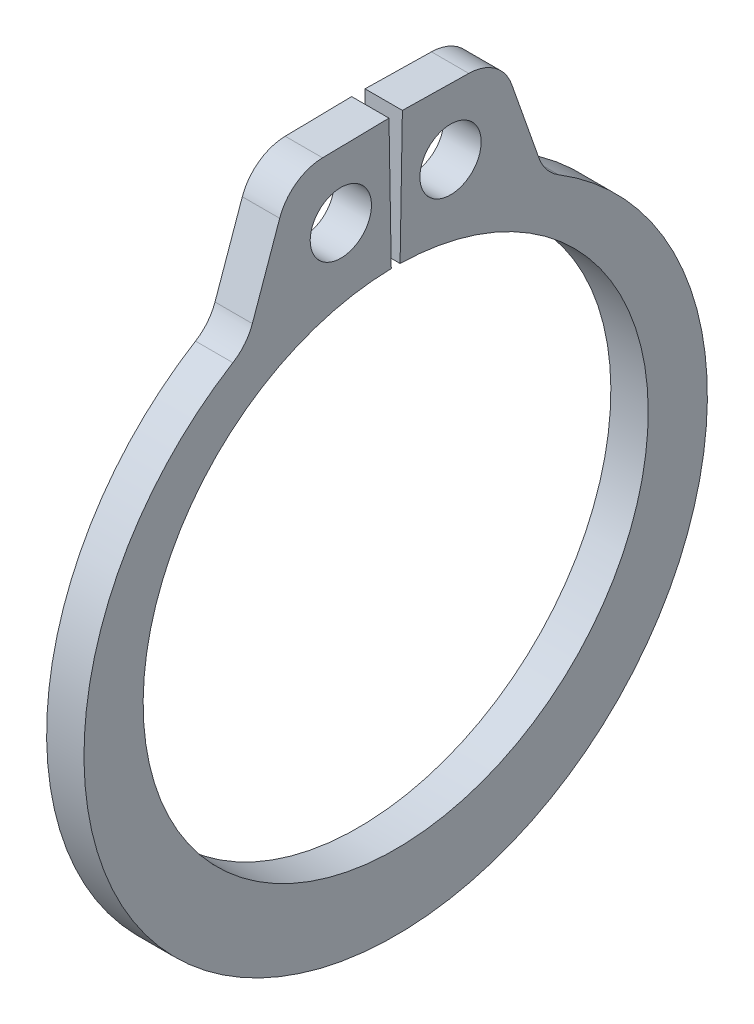
ISO-10303-21;
HEADER;
FILE_DESCRIPTION(('STEP AP214'),'2;1');
FILE_NAME('part.step','',(''),(''),'','','');
FILE_SCHEMA(('AUTOMOTIVE_DESIGN { 1 0 10303 214 1 1 1 1 }'));
ENDSEC;
DATA;
#1=APPLICATION_CONTEXT('core data for automotive mechanical design processes');
#2=APPLICATION_PROTOCOL_DEFINITION('international standard','automotive_design',2000,#1);
#3=PRODUCT_CONTEXT('',#1,'mechanical');
#4=PRODUCT('Part','Part','',(#3));
#5=PRODUCT_RELATED_PRODUCT_CATEGORY('part','',(#4));
#6=PRODUCT_DEFINITION_FORMATION('','',#4);
#7=PRODUCT_DEFINITION_CONTEXT('part definition',#1,'design');
#8=PRODUCT_DEFINITION('design','',#6,#7);
#9=PRODUCT_DEFINITION_SHAPE('','',#8);
#10=(LENGTH_UNIT() NAMED_UNIT(*) SI_UNIT(.MILLI.,.METRE.));
#11=(NAMED_UNIT(*) PLANE_ANGLE_UNIT() SI_UNIT($,.RADIAN.));
#12=(NAMED_UNIT(*) SI_UNIT($,.STERADIAN.) SOLID_ANGLE_UNIT());
#13=UNCERTAINTY_MEASURE_WITH_UNIT(LENGTH_MEASURE(1.E-05),#10,'distance_accuracy_value','');
#14=(GEOMETRIC_REPRESENTATION_CONTEXT(3) GLOBAL_UNCERTAINTY_ASSIGNED_CONTEXT((#13)) GLOBAL_UNIT_ASSIGNED_CONTEXT((#10,
#11,#12)) REPRESENTATION_CONTEXT('',''));
#15=CARTESIAN_POINT('',(0.,0.,0.));
#16=DIRECTION('',(0.,0.,1.));
#17=DIRECTION('',(1.,0.,0.));
#18=AXIS2_PLACEMENT_3D('',#15,#16,#17);
#19=CARTESIAN_POINT('',(0.3175,0.,0.));
#20=DIRECTION('',(1.,0.,0.));
#21=DIRECTION('',(0.,0.,-1.));
#22=AXIS2_PLACEMENT_3D('',#19,#20,#21);
#23=PLANE('',#22);
#24=CARTESIAN_POINT('',(0.3175,5.39474739325938,-0.932493347387071));
#25=DIRECTION('',(-1.,0.,0.));
#26=DIRECTION('',(0.,0.,1.));
#27=AXIS2_PLACEMENT_3D('',#24,#25,#26);
#28=CIRCLE('',#27,0.5207);
#29=CARTESIAN_POINT('',(0.3175,5.39474739325938,-0.411793347387071));
#30=VERTEX_POINT('',#29);
#31=EDGE_CURVE('E171',#30,#30,#28,.T.);
#32=ORIENTED_EDGE('',*,*,#31,.T.);
#33=EDGE_LOOP('',(#32));
#34=FACE_BOUND('',#33,.T.);
#35=CARTESIAN_POINT('',(0.3175,5.39474739325938,0.932493347387071));
#36=DIRECTION('',(-1.,0.,0.));
#37=DIRECTION('',(0.,0.,1.));
#38=AXIS2_PLACEMENT_3D('',#35,#36,#37);
#39=CIRCLE('',#38,0.5207);
#40=CARTESIAN_POINT('',(0.3175,5.39474739325938,1.45319334738707));
#41=VERTEX_POINT('',#40);
#42=EDGE_CURVE('E109',#41,#41,#39,.T.);
#43=ORIENTED_EDGE('',*,*,#42,.T.);
#44=EDGE_LOOP('',(#43));
#45=FACE_BOUND('',#44,.T.);
#46=CARTESIAN_POINT('',(0.3175,0.,0.));
#47=DIRECTION('',(-1.,0.,0.));
#48=DIRECTION('',(0.,0.,1.));
#49=AXIS2_PLACEMENT_3D('',#46,#47,#48);
#50=CIRCLE('',#49,4.2926);
#51=CARTESIAN_POINT('',(0.3175,4.29194621622833,-0.0749161998726857));
#52=VERTEX_POINT('',#51);
#53=CARTESIAN_POINT('',(0.3175,4.29194621622832,0.0749161998726854));
#54=VERTEX_POINT('',#53);
#55=EDGE_CURVE('E177',#52,#54,#50,.T.);
#56=ORIENTED_EDGE('',*,*,#55,.T.);
#57=DIRECTION('',(0.,-0.999847695156391,-0.017452406437283));
#58=VECTOR('',#57,1.);
#59=CARTESIAN_POINT('',(0.3175,4.29194621622832,0.0749161998726854));
#60=LINE('',#59,#58);
#61=CARTESIAN_POINT('',(0.3175,6.5268057844419,0.113925818741302));
#62=VERTEX_POINT('',#61);
#63=EDGE_CURVE('E124',#54,#62,#60,.F.);
#64=ORIENTED_EDGE('',*,*,#63,.T.);
#65=DIRECTION('',(0.,0.017452406437294,-0.999847695156391));
#66=VECTOR('',#65,1.);
#67=CARTESIAN_POINT('',(0.3175,6.5268057844419,0.113925818741303));
#68=LINE('',#67,#66);
#69=CARTESIAN_POINT('',(0.3175,6.50710052961542,1.2428391116738));
#70=VERTEX_POINT('',#69);
#71=EDGE_CURVE('E119',#62,#70,#68,.F.);
#72=ORIENTED_EDGE('',*,*,#71,.T.);
#73=CARTESIAN_POINT('',(0.3175,5.71982045444927,1.22909708684508));
#74=DIRECTION('',(-1.,0.,0.));
#75=DIRECTION('',(0.,0.,1.));
#76=AXIS2_PLACEMENT_3D('',#73,#74,#75);
#77=CIRCLE('',#76,0.7874);
#78=CARTESIAN_POINT('',(0.3175,5.98129100900125,1.9718163535282));
#79=VERTEX_POINT('',#78);
#80=EDGE_CURVE('E112',#79,#70,#77,.T.);
#81=ORIENTED_EDGE('',*,*,#80,.F.);
#82=DIRECTION('',(0.,0.94325535519825,-0.332068268417539));
#83=VECTOR('',#82,1.);
#84=CARTESIAN_POINT('',(0.3175,6.49754857029043,1.79007049490148));
#85=LINE('',#84,#83);
#86=CARTESIAN_POINT('',(0.3175,4.66344515220106,2.43575731002231));
#87=VERTEX_POINT('',#86);
#88=EDGE_CURVE('E107',#79,#87,#85,.F.);
#89=ORIENTED_EDGE('',*,*,#88,.T.);
#90=CARTESIAN_POINT('',(0.3175,4.92491570675303,3.17847657670541));
#91=DIRECTION('',(-1.,0.,0.));
#92=DIRECTION('',(0.,0.,1.));
#93=AXIS2_PLACEMENT_3D('',#90,#91,#92);
#94=CIRCLE('',#93,0.7874);
#95=CARTESIAN_POINT('',(0.3175,4.25345366496523,2.76721329553604));
#96=VERTEX_POINT('',#95);
#97=EDGE_CURVE('E20',#87,#96,#94,.T.);
#98=ORIENTED_EDGE('',*,*,#97,.T.);
#99=CARTESIAN_POINT('',(0.3175,-0.264524901465116,0.));
#100=DIRECTION('',(-1.,0.,0.));
#101=DIRECTION('',(0.,0.,1.));
#102=AXIS2_PLACEMENT_3D('',#99,#100,#101);
#103=CIRCLE('',#102,5.29807509853489);
#104=CARTESIAN_POINT('',(0.3175,4.25345366496524,-2.76721329553605));
#105=VERTEX_POINT('',#104);
#106=EDGE_CURVE('E105',#105,#96,#103,.T.);
#107=ORIENTED_EDGE('',*,*,#106,.F.);
#108=CARTESIAN_POINT('',(0.3175,4.92491570675303,-3.17847657670541));
#109=DIRECTION('',(-1.,0.,0.));
#110=DIRECTION('',(0.,0.,1.));
#111=AXIS2_PLACEMENT_3D('',#108,#109,#110);
#112=CIRCLE('',#111,0.7874);
#113=CARTESIAN_POINT('',(0.3175,4.66344515220106,-2.43575731002231));
#114=VERTEX_POINT('',#113);
#115=EDGE_CURVE('E181',#105,#114,#112,.T.);
#116=ORIENTED_EDGE('',*,*,#115,.T.);
#117=DIRECTION('',(0.,-0.94325535519825,-0.332068268417539));
#118=VECTOR('',#117,1.);
#119=CARTESIAN_POINT('',(0.3175,6.49754857029043,-1.79007049490148));
#120=LINE('',#119,#118);
#121=CARTESIAN_POINT('',(0.3175,5.98129100900124,-1.97181635352819));
#122=VERTEX_POINT('',#121);
#123=EDGE_CURVE('E142',#114,#122,#120,.F.);
#124=ORIENTED_EDGE('',*,*,#123,.T.);
#125=CARTESIAN_POINT('',(0.3175,5.71982045444927,-1.22909708684508));
#126=DIRECTION('',(-1.,0.,0.));
#127=DIRECTION('',(0.,0.,1.));
#128=AXIS2_PLACEMENT_3D('',#125,#126,#127);
#129=CIRCLE('',#128,0.7874);
#130=CARTESIAN_POINT('',(0.3175,6.50710052961543,-1.2428391116738));
#131=VERTEX_POINT('',#130);
#132=EDGE_CURVE('E144',#131,#122,#129,.T.);
#133=ORIENTED_EDGE('',*,*,#132,.F.);
#134=DIRECTION('',(0.,-0.017452406437294,-0.999847695156391));
#135=VECTOR('',#134,1.);
#136=CARTESIAN_POINT('',(0.3175,6.5268057844419,-0.113925818741303));
#137=LINE('',#136,#135);
#138=CARTESIAN_POINT('',(0.3175,6.5268057844419,-0.113925818741301));
#139=VERTEX_POINT('',#138);
#140=EDGE_CURVE('E136',#131,#139,#137,.F.);
#141=ORIENTED_EDGE('',*,*,#140,.T.);
#142=DIRECTION('',(0.,0.999847695156391,-0.017452406437283));
#143=VECTOR('',#142,1.);
#144=CARTESIAN_POINT('',(0.3175,4.29194621622832,-0.0749161998726854));
#145=LINE('',#144,#143);
#146=EDGE_CURVE('E130',#139,#52,#145,.F.);
#147=ORIENTED_EDGE('',*,*,#146,.T.);
#148=EDGE_LOOP('',(#56,#64,#72,#81,#89,#98,#107,#116,#124,#133,#141,#147));
#149=FACE_BOUND('',#148,.T.);
#150=ADVANCED_FACE('F17',(#34,#45,#149),#23,.T.);
#151=CARTESIAN_POINT('',(0.3175,4.92491570675303,3.17847657670541));
#152=DIRECTION('',(-1.,0.,0.));
#153=DIRECTION('',(0.,0.,1.));
#154=AXIS2_PLACEMENT_3D('',#151,#152,#153);
#155=CYLINDRICAL_SURFACE('',#154,0.7874);
#156=DIRECTION('',(1.,0.,0.));
#157=VECTOR('',#156,1.);
#158=CARTESIAN_POINT('',(0.3175,4.66344515220106,2.43575731002232));
#159=LINE('',#158,#157);
#160=CARTESIAN_POINT('',(-0.3175,4.66344515220106,2.4357573100223));
#161=VERTEX_POINT('',#160);
#162=EDGE_CURVE('E101',#87,#161,#159,.F.);
#163=ORIENTED_EDGE('',*,*,#162,.T.);
#164=CARTESIAN_POINT('',(-0.3175,4.92491570675303,3.17847657670541));
#165=DIRECTION('',(-1.,0.,0.));
#166=DIRECTION('',(0.,0.,1.));
#167=AXIS2_PLACEMENT_3D('',#164,#165,#166);
#168=CIRCLE('',#167,0.7874);
#169=CARTESIAN_POINT('',(-0.3175,4.25345366496523,2.76721329553604));
#170=VERTEX_POINT('',#169);
#171=EDGE_CURVE('E169',#161,#170,#168,.T.);
#172=ORIENTED_EDGE('',*,*,#171,.T.);
#173=DIRECTION('',(-1.,0.,0.));
#174=VECTOR('',#173,1.);
#175=CARTESIAN_POINT('',(0.3175,4.25345366496523,2.76721329553604));
#176=LINE('',#175,#174);
#177=EDGE_CURVE('E102',#96,#170,#176,.T.);
#178=ORIENTED_EDGE('',*,*,#177,.F.);
#179=ORIENTED_EDGE('',*,*,#97,.F.);
#180=EDGE_LOOP('',(#163,#172,#178,#179));
#181=FACE_BOUND('',#180,.T.);
#182=ADVANCED_FACE('F99',(#181),#155,.F.);
#183=CARTESIAN_POINT('',(0.3175,-0.264524901465116,0.));
#184=DIRECTION('',(-1.,0.,0.));
#185=DIRECTION('',(0.,0.,1.));
#186=AXIS2_PLACEMENT_3D('',#183,#184,#185);
#187=CYLINDRICAL_SURFACE('',#186,5.29807509853489);
#188=CARTESIAN_POINT('',(-0.3175,-0.264524901465116,0.));
#189=DIRECTION('',(-1.,0.,0.));
#190=DIRECTION('',(0.,0.,1.));
#191=AXIS2_PLACEMENT_3D('',#188,#189,#190);
#192=CIRCLE('',#191,5.29807509853489);
#193=CARTESIAN_POINT('',(-0.3175,4.25345366496524,-2.76721329553605));
#194=VERTEX_POINT('',#193);
#195=EDGE_CURVE('E166',#170,#194,#192,.F.);
#196=ORIENTED_EDGE('',*,*,#195,.T.);
#197=DIRECTION('',(-1.,0.,0.));
#198=VECTOR('',#197,1.);
#199=CARTESIAN_POINT('',(0.3175,4.25345366496524,-2.76721329553605));
#200=LINE('',#199,#198);
#201=EDGE_CURVE('E182',#194,#105,#200,.F.);
#202=ORIENTED_EDGE('',*,*,#201,.T.);
#203=ORIENTED_EDGE('',*,*,#106,.T.);
#204=ORIENTED_EDGE('',*,*,#177,.T.);
#205=EDGE_LOOP('',(#196,#202,#203,#204));
#206=FACE_BOUND('',#205,.T.);
#207=ADVANCED_FACE('F265',(#206),#187,.T.);
#208=CARTESIAN_POINT('',(0.3175,4.92491570675303,-3.17847657670541));
#209=DIRECTION('',(-1.,0.,0.));
#210=DIRECTION('',(0.,0.,1.));
#211=AXIS2_PLACEMENT_3D('',#208,#209,#210);
#212=CYLINDRICAL_SURFACE('',#211,0.7874);
#213=ORIENTED_EDGE('',*,*,#201,.F.);
#214=CARTESIAN_POINT('',(-0.3175,4.92491570675303,-3.17847657670541));
#215=DIRECTION('',(-1.,0.,0.));
#216=DIRECTION('',(0.,0.,1.));
#217=AXIS2_PLACEMENT_3D('',#214,#215,#216);
#218=CIRCLE('',#217,0.7874);
#219=CARTESIAN_POINT('',(-0.3175,4.66344515220106,-2.4357573100223));
#220=VERTEX_POINT('',#219);
#221=EDGE_CURVE('E163',#194,#220,#218,.T.);
#222=ORIENTED_EDGE('',*,*,#221,.T.);
#223=DIRECTION('',(1.,0.,0.));
#224=VECTOR('',#223,1.);
#225=CARTESIAN_POINT('',(0.3175,4.66344515220106,-2.43575731002232));
#226=LINE('',#225,#224);
#227=EDGE_CURVE('E145',#220,#114,#226,.T.);
#228=ORIENTED_EDGE('',*,*,#227,.T.);
#229=ORIENTED_EDGE('',*,*,#115,.F.);
#230=EDGE_LOOP('',(#213,#222,#228,#229));
#231=FACE_BOUND('',#230,.T.);
#232=ADVANCED_FACE('F264',(#231),#212,.F.);
#233=CARTESIAN_POINT('',(0.3175,6.49754857029043,-1.79007049490148));
#234=DIRECTION('',(0.,-0.332068268417539,0.94325535519825));
#235=DIRECTION('',(0.,-0.94325535519825,-0.332068268417539));
#236=AXIS2_PLACEMENT_3D('',#233,#234,#235);
#237=PLANE('',#236);
#238=ORIENTED_EDGE('',*,*,#227,.F.);
#239=DIRECTION('',(0.,0.943255355198251,0.332068268417537));
#240=VECTOR('',#239,1.);
#241=CARTESIAN_POINT('',(-0.3175,4.66344515220105,-2.4357573100223));
#242=LINE('',#241,#240);
#243=CARTESIAN_POINT('',(-0.3175,5.98129100900124,-1.97181635352819));
#244=VERTEX_POINT('',#243);
#245=EDGE_CURVE('E162',#220,#244,#242,.T.);
#246=ORIENTED_EDGE('',*,*,#245,.T.);
#247=DIRECTION('',(-1.,0.,0.));
#248=VECTOR('',#247,1.);
#249=CARTESIAN_POINT('',(0.3175,5.98129100900124,-1.97181635352818));
#250=LINE('',#249,#248);
#251=EDGE_CURVE('E180',#122,#244,#250,.T.);
#252=ORIENTED_EDGE('',*,*,#251,.F.);
#253=ORIENTED_EDGE('',*,*,#123,.F.);
#254=EDGE_LOOP('',(#238,#246,#252,#253));
#255=FACE_BOUND('',#254,.T.);
#256=ADVANCED_FACE('F261',(#255),#237,.F.);
#257=CARTESIAN_POINT('',(0.3175,5.71982045444927,-1.22909708684508));
#258=DIRECTION('',(-1.,0.,0.));
#259=DIRECTION('',(0.,0.,1.));
#260=AXIS2_PLACEMENT_3D('',#257,#258,#259);
#261=CYLINDRICAL_SURFACE('',#260,0.7874);
#262=CARTESIAN_POINT('',(-0.3175,5.71982045444927,-1.22909708684508));
#263=DIRECTION('',(-1.,0.,0.));
#264=DIRECTION('',(0.,0.,1.));
#265=AXIS2_PLACEMENT_3D('',#262,#263,#264);
#266=CIRCLE('',#265,0.7874);
#267=CARTESIAN_POINT('',(-0.3175,6.50710052961543,-1.2428391116738));
#268=VERTEX_POINT('',#267);
#269=EDGE_CURVE('E158',#244,#268,#266,.F.);
#270=ORIENTED_EDGE('',*,*,#269,.T.);
#271=DIRECTION('',(1.,0.,0.));
#272=VECTOR('',#271,1.);
#273=CARTESIAN_POINT('',(0.3175,6.50710052961543,-1.2428391116738));
#274=LINE('',#273,#272);
#275=EDGE_CURVE('E139',#268,#131,#274,.T.);
#276=ORIENTED_EDGE('',*,*,#275,.T.);
#277=ORIENTED_EDGE('',*,*,#132,.T.);
#278=ORIENTED_EDGE('',*,*,#251,.T.);
#279=EDGE_LOOP('',(#270,#276,#277,#278));
#280=FACE_BOUND('',#279,.T.);
#281=ADVANCED_FACE('F256',(#280),#261,.T.);
#282=CARTESIAN_POINT('',(0.3175,6.5268057844419,-0.113925818741303));
#283=DIRECTION('',(0.,-0.999847695156391,0.017452406437294));
#284=DIRECTION('',(0.,-0.017452406437294,-0.999847695156391));
#285=AXIS2_PLACEMENT_3D('',#282,#283,#284);
#286=PLANE('',#285);
#287=ORIENTED_EDGE('',*,*,#275,.F.);
#288=DIRECTION('',(0.,0.0174524064372881,0.999847695156391));
#289=VECTOR('',#288,1.);
#290=CARTESIAN_POINT('',(-0.3175,6.50710052961543,-1.2428391116738));
#291=LINE('',#290,#289);
#292=CARTESIAN_POINT('',(-0.3175,6.5268057844419,-0.113925818741302));
#293=VERTEX_POINT('',#292);
#294=EDGE_CURVE('E161',#268,#293,#291,.T.);
#295=ORIENTED_EDGE('',*,*,#294,.T.);
#296=DIRECTION('',(1.,0.,0.));
#297=VECTOR('',#296,1.);
#298=CARTESIAN_POINT('',(0.3175,6.5268057844419,-0.113925818741301));
#299=LINE('',#298,#297);
#300=EDGE_CURVE('E133',#293,#139,#299,.T.);
#301=ORIENTED_EDGE('',*,*,#300,.T.);
#302=ORIENTED_EDGE('',*,*,#140,.F.);
#303=EDGE_LOOP('',(#287,#295,#301,#302));
#304=FACE_BOUND('',#303,.T.);
#305=ADVANCED_FACE('F251',(#304),#286,.F.);
#306=CARTESIAN_POINT('',(0.3175,4.29194621622832,-0.0749161998726854));
#307=DIRECTION('',(0.,-0.017452406437283,-0.999847695156391));
#308=DIRECTION('',(0.,0.999847695156391,-0.017452406437283));
#309=AXIS2_PLACEMENT_3D('',#306,#307,#308);
#310=PLANE('',#309);
#311=DIRECTION('',(-1.,0.,0.));
#312=VECTOR('',#311,1.);
#313=CARTESIAN_POINT('',(0.3175,4.29194621622833,-0.0749161998726859));
#314=LINE('',#313,#312);
#315=CARTESIAN_POINT('',(-0.3175,4.29194621622833,-0.0749161998726858));
#316=VERTEX_POINT('',#315);
#317=EDGE_CURVE('E132',#316,#52,#314,.F.);
#318=ORIENTED_EDGE('',*,*,#317,.T.);
#319=ORIENTED_EDGE('',*,*,#146,.F.);
#320=ORIENTED_EDGE('',*,*,#300,.F.);
#321=DIRECTION('',(0.,-0.999847695156391,0.017452406437284));
#322=VECTOR('',#321,1.);
#323=CARTESIAN_POINT('',(-0.3175,6.5268057844419,-0.113925818741303));
#324=LINE('',#323,#322);
#325=EDGE_CURVE('E157',#293,#316,#324,.T.);
#326=ORIENTED_EDGE('',*,*,#325,.T.);
#327=EDGE_LOOP('',(#318,#319,#320,#326));
#328=FACE_BOUND('',#327,.T.);
#329=ADVANCED_FACE('F246',(#328),#310,.F.);
#330=CARTESIAN_POINT('',(0.3175,0.,0.));
#331=DIRECTION('',(-1.,0.,0.));
#332=DIRECTION('',(0.,0.,1.));
#333=AXIS2_PLACEMENT_3D('',#330,#331,#332);
#334=CYLINDRICAL_SURFACE('',#333,4.2926);
#335=ORIENTED_EDGE('',*,*,#317,.F.);
#336=CARTESIAN_POINT('',(-0.3175,0.,0.));
#337=DIRECTION('',(-1.,0.,0.));
#338=DIRECTION('',(0.,0.,1.));
#339=AXIS2_PLACEMENT_3D('',#336,#337,#338);
#340=CIRCLE('',#339,4.2926);
#341=CARTESIAN_POINT('',(-0.3175,4.29194621622832,0.0749161998726854));
#342=VERTEX_POINT('',#341);
#343=EDGE_CURVE('E153',#316,#342,#340,.T.);
#344=ORIENTED_EDGE('',*,*,#343,.T.);
#345=DIRECTION('',(1.,0.,0.));
#346=VECTOR('',#345,1.);
#347=CARTESIAN_POINT('',(0.3175,4.29194621622832,0.0749161998726854));
#348=LINE('',#347,#346);
#349=EDGE_CURVE('E127',#342,#54,#348,.T.);
#350=ORIENTED_EDGE('',*,*,#349,.T.);
#351=ORIENTED_EDGE('',*,*,#55,.F.);
#352=EDGE_LOOP('',(#335,#344,#350,#351));
#353=FACE_BOUND('',#352,.T.);
#354=ADVANCED_FACE('F241',(#353),#334,.F.);
#355=CARTESIAN_POINT('',(0.3175,4.29194621622832,0.0749161998726854));
#356=DIRECTION('',(0.,-0.017452406437283,0.999847695156391));
#357=DIRECTION('',(0.,-0.999847695156391,-0.017452406437283));
#358=AXIS2_PLACEMENT_3D('',#355,#356,#357);
#359=PLANE('',#358);
#360=DIRECTION('',(1.,0.,0.));
#361=VECTOR('',#360,1.);
#362=CARTESIAN_POINT('',(0.3175,6.5268057844419,0.113925818741303));
#363=LINE('',#362,#361);
#364=CARTESIAN_POINT('',(-0.3175,6.5268057844419,0.113925818741303));
#365=VERTEX_POINT('',#364);
#366=EDGE_CURVE('E121',#365,#62,#363,.T.);
#367=ORIENTED_EDGE('',*,*,#366,.T.);
#368=ORIENTED_EDGE('',*,*,#63,.F.);
#369=ORIENTED_EDGE('',*,*,#349,.F.);
#370=DIRECTION('',(0.,0.999847695156391,0.017452406437284));
#371=VECTOR('',#370,1.);
#372=CARTESIAN_POINT('',(-0.3175,4.29194621622832,0.0749161998726854));
#373=LINE('',#372,#371);
#374=EDGE_CURVE('E156',#342,#365,#373,.T.);
#375=ORIENTED_EDGE('',*,*,#374,.T.);
#376=EDGE_LOOP('',(#367,#368,#369,#375));
#377=FACE_BOUND('',#376,.T.);
#378=ADVANCED_FACE('F237',(#377),#359,.F.);
#379=CARTESIAN_POINT('',(0.3175,6.5268057844419,0.113925818741303));
#380=DIRECTION('',(0.,-0.999847695156391,-0.017452406437294));
#381=DIRECTION('',(0.,0.017452406437294,-0.999847695156391));
#382=AXIS2_PLACEMENT_3D('',#379,#380,#381);
#383=PLANE('',#382);
#384=DIRECTION('',(-1.,0.,0.));
#385=VECTOR('',#384,1.);
#386=CARTESIAN_POINT('',(0.3175,6.50710052961541,1.2428391116738));
#387=LINE('',#386,#385);
#388=CARTESIAN_POINT('',(-0.3175,6.50710052961542,1.2428391116738));
#389=VERTEX_POINT('',#388);
#390=EDGE_CURVE('E114',#70,#389,#387,.T.);
#391=ORIENTED_EDGE('',*,*,#390,.F.);
#392=ORIENTED_EDGE('',*,*,#71,.F.);
#393=ORIENTED_EDGE('',*,*,#366,.F.);
#394=DIRECTION('',(0.,-0.0174524064372881,0.999847695156391));
#395=VECTOR('',#394,1.);
#396=CARTESIAN_POINT('',(-0.3175,6.5268057844419,0.113925818741303));
#397=LINE('',#396,#395);
#398=EDGE_CURVE('E152',#365,#389,#397,.T.);
#399=ORIENTED_EDGE('',*,*,#398,.T.);
#400=EDGE_LOOP('',(#391,#392,#393,#399));
#401=FACE_BOUND('',#400,.T.);
#402=ADVANCED_FACE('F228',(#401),#383,.F.);
#403=CARTESIAN_POINT('',(0.3175,5.71982045444927,1.22909708684508));
#404=DIRECTION('',(-1.,0.,0.));
#405=DIRECTION('',(0.,0.,1.));
#406=AXIS2_PLACEMENT_3D('',#403,#404,#405);
#407=CYLINDRICAL_SURFACE('',#406,0.7874);
#408=CARTESIAN_POINT('',(-0.3175,5.71982045444927,1.22909708684508));
#409=DIRECTION('',(-1.,0.,0.));
#410=DIRECTION('',(0.,0.,1.));
#411=AXIS2_PLACEMENT_3D('',#408,#409,#410);
#412=CIRCLE('',#411,0.7874);
#413=CARTESIAN_POINT('',(-0.3175,5.98129100900124,1.9718163535282));
#414=VERTEX_POINT('',#413);
#415=EDGE_CURVE('E149',#389,#414,#412,.F.);
#416=ORIENTED_EDGE('',*,*,#415,.T.);
#417=DIRECTION('',(1.,0.,0.));
#418=VECTOR('',#417,1.);
#419=CARTESIAN_POINT('',(0.3175,5.98129100900125,1.9718163535282));
#420=LINE('',#419,#418);
#421=EDGE_CURVE('E35',#414,#79,#420,.T.);
#422=ORIENTED_EDGE('',*,*,#421,.T.);
#423=ORIENTED_EDGE('',*,*,#80,.T.);
#424=ORIENTED_EDGE('',*,*,#390,.T.);
#425=EDGE_LOOP('',(#416,#422,#423,#424));
#426=FACE_BOUND('',#425,.T.);
#427=ADVANCED_FACE('F292',(#426),#407,.T.);
#428=CARTESIAN_POINT('',(0.3175,6.49754857029043,1.79007049490148));
#429=DIRECTION('',(0.,-0.332068268417539,-0.94325535519825));
#430=DIRECTION('',(0.,0.94325535519825,-0.332068268417539));
#431=AXIS2_PLACEMENT_3D('',#428,#429,#430);
#432=PLANE('',#431);
#433=ORIENTED_EDGE('',*,*,#162,.F.);
#434=ORIENTED_EDGE('',*,*,#88,.F.);
#435=ORIENTED_EDGE('',*,*,#421,.F.);
#436=DIRECTION('',(0.,-0.943255355198251,0.332068268417537));
#437=VECTOR('',#436,1.);
#438=CARTESIAN_POINT('',(-0.3175,5.98129100900125,1.97181635352819));
#439=LINE('',#438,#437);
#440=EDGE_CURVE('E108',#414,#161,#439,.T.);
#441=ORIENTED_EDGE('',*,*,#440,.T.);
#442=EDGE_LOOP('',(#433,#434,#435,#441));
#443=FACE_BOUND('',#442,.T.);
#444=ADVANCED_FACE('F106',(#443),#432,.F.);
#445=CARTESIAN_POINT('',(0.3175,5.39474739325938,0.932493347387071));
#446=DIRECTION('',(-1.,0.,0.));
#447=DIRECTION('',(0.,0.,1.));
#448=AXIS2_PLACEMENT_3D('',#445,#446,#447);
#449=CYLINDRICAL_SURFACE('',#448,0.5207);
#450=ORIENTED_EDGE('',*,*,#42,.F.);
#451=EDGE_LOOP('',(#450));
#452=FACE_BOUND('',#451,.T.);
#453=CARTESIAN_POINT('',(-0.3175,5.39474739325938,0.932493347387071));
#454=DIRECTION('',(-1.,0.,0.));
#455=DIRECTION('',(0.,0.,1.));
#456=AXIS2_PLACEMENT_3D('',#453,#454,#455);
#457=CIRCLE('',#456,0.5207);
#458=CARTESIAN_POINT('',(-0.3175,5.39474739325938,1.45319334738707));
#459=VERTEX_POINT('',#458);
#460=EDGE_CURVE('E26',#459,#459,#457,.T.);
#461=ORIENTED_EDGE('',*,*,#460,.T.);
#462=EDGE_LOOP('',(#461));
#463=FACE_BOUND('',#462,.T.);
#464=ADVANCED_FACE('F281',(#452,#463),#449,.F.);
#465=CARTESIAN_POINT('',(0.3175,5.39474739325938,-0.932493347387071));
#466=DIRECTION('',(-1.,0.,0.));
#467=DIRECTION('',(0.,0.,1.));
#468=AXIS2_PLACEMENT_3D('',#465,#466,#467);
#469=CYLINDRICAL_SURFACE('',#468,0.5207);
#470=ORIENTED_EDGE('',*,*,#31,.F.);
#471=EDGE_LOOP('',(#470));
#472=FACE_BOUND('',#471,.T.);
#473=CARTESIAN_POINT('',(-0.3175,5.39474739325938,-0.932493347387071));
#474=DIRECTION('',(-1.,0.,0.));
#475=DIRECTION('',(0.,0.,1.));
#476=AXIS2_PLACEMENT_3D('',#473,#474,#475);
#477=CIRCLE('',#476,0.5207);
#478=CARTESIAN_POINT('',(-0.3175,5.39474739325938,-0.411793347387071));
#479=VERTEX_POINT('',#478);
#480=EDGE_CURVE('E11',#479,#479,#477,.T.);
#481=ORIENTED_EDGE('',*,*,#480,.T.);
#482=EDGE_LOOP('',(#481));
#483=FACE_BOUND('',#482,.T.);
#484=ADVANCED_FACE('F275',(#472,#483),#469,.F.);
#485=CARTESIAN_POINT('',(-0.3175,0.,0.));
#486=DIRECTION('',(1.,0.,0.));
#487=DIRECTION('',(0.,0.,-1.));
#488=AXIS2_PLACEMENT_3D('',#485,#486,#487);
#489=PLANE('',#488);
#490=ORIENTED_EDGE('',*,*,#480,.F.);
#491=EDGE_LOOP('',(#490));
#492=FACE_BOUND('',#491,.T.);
#493=ORIENTED_EDGE('',*,*,#460,.F.);
#494=EDGE_LOOP('',(#493));
#495=FACE_BOUND('',#494,.T.);
#496=ORIENTED_EDGE('',*,*,#415,.F.);
#497=ORIENTED_EDGE('',*,*,#398,.F.);
#498=ORIENTED_EDGE('',*,*,#374,.F.);
#499=ORIENTED_EDGE('',*,*,#343,.F.);
#500=ORIENTED_EDGE('',*,*,#325,.F.);
#501=ORIENTED_EDGE('',*,*,#294,.F.);
#502=ORIENTED_EDGE('',*,*,#269,.F.);
#503=ORIENTED_EDGE('',*,*,#245,.F.);
#504=ORIENTED_EDGE('',*,*,#221,.F.);
#505=ORIENTED_EDGE('',*,*,#195,.F.);
#506=ORIENTED_EDGE('',*,*,#171,.F.);
#507=ORIENTED_EDGE('',*,*,#440,.F.);
#508=EDGE_LOOP('',(#496,#497,#498,#499,#500,#501,#502,#503,#504,#505,#506,#507));
#509=FACE_BOUND('',#508,.T.);
#510=ADVANCED_FACE('F233',(#492,#495,#509),#489,.F.);
#511=CLOSED_SHELL('',(#150,#182,#207,#232,#256,#281,#305,#329,#354,#378,#402,#427,#444,#464,
#484,#510));
#512=MANIFOLD_SOLID_BREP('B1',#511);
#513=ADVANCED_BREP_SHAPE_REPRESENTATION('',(#18,#512),#14);
#514=SHAPE_DEFINITION_REPRESENTATION(#9,#513);
ENDSEC;
END-ISO-10303-21;
